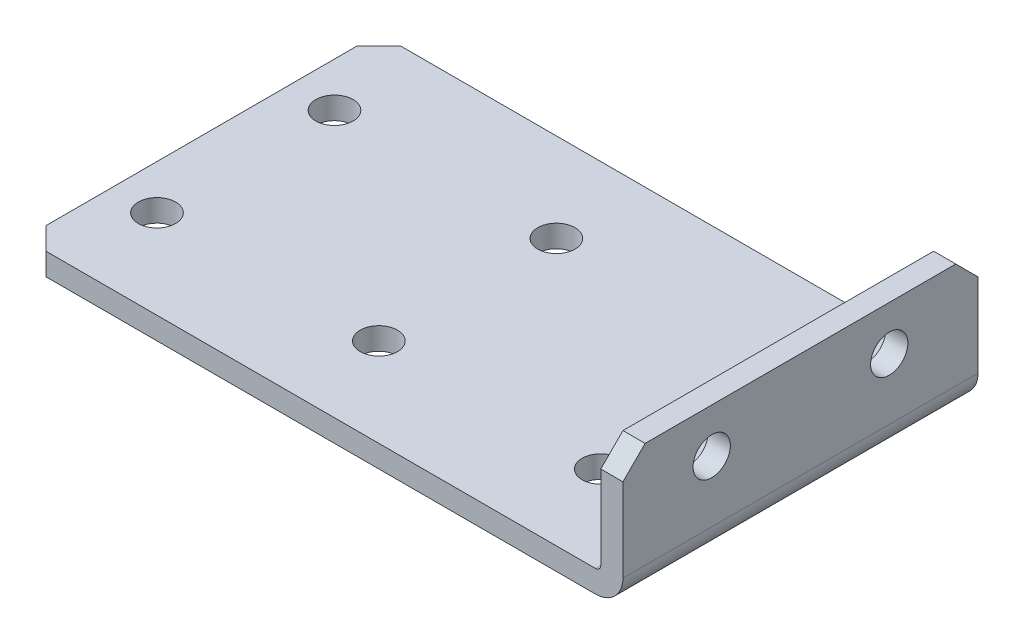
ISO-10303-21;
HEADER;
FILE_DESCRIPTION(('STEP AP214'),'2;1');
FILE_NAME('part.step','',(''),(''),'','','');
FILE_SCHEMA(('AUTOMOTIVE_DESIGN { 1 0 10303 214 1 1 1 1 }'));
ENDSEC;
DATA;
#1=APPLICATION_CONTEXT('core data for automotive mechanical design processes');
#2=APPLICATION_PROTOCOL_DEFINITION('international standard','automotive_design',2000,#1);
#3=PRODUCT_CONTEXT('',#1,'mechanical');
#4=PRODUCT('Part','Part','',(#3));
#5=PRODUCT_RELATED_PRODUCT_CATEGORY('part','',(#4));
#6=PRODUCT_DEFINITION_FORMATION('','',#4);
#7=PRODUCT_DEFINITION_CONTEXT('part definition',#1,'design');
#8=PRODUCT_DEFINITION('design','',#6,#7);
#9=PRODUCT_DEFINITION_SHAPE('','',#8);
#10=(LENGTH_UNIT() NAMED_UNIT(*) SI_UNIT(.MILLI.,.METRE.));
#11=(NAMED_UNIT(*) PLANE_ANGLE_UNIT() SI_UNIT($,.RADIAN.));
#12=(NAMED_UNIT(*) SI_UNIT($,.STERADIAN.) SOLID_ANGLE_UNIT());
#13=UNCERTAINTY_MEASURE_WITH_UNIT(LENGTH_MEASURE(1.E-05),#10,'distance_accuracy_value','');
#14=(GEOMETRIC_REPRESENTATION_CONTEXT(3) GLOBAL_UNCERTAINTY_ASSIGNED_CONTEXT((#13)) GLOBAL_UNIT_ASSIGNED_CONTEXT((#10,
#11,#12)) REPRESENTATION_CONTEXT('',''));
#15=CARTESIAN_POINT('',(0.,0.,0.));
#16=DIRECTION('',(0.,0.,1.));
#17=DIRECTION('',(1.,0.,0.));
#18=AXIS2_PLACEMENT_3D('',#15,#16,#17);
#19=CARTESIAN_POINT('',(85.7250000000001,12.7000000000001,-25.4));
#20=DIRECTION('',(-1.,0.,0.));
#21=DIRECTION('',(0.,-1.,0.));
#22=AXIS2_PLACEMENT_3D('',#19,#20,#21);
#23=CYLINDRICAL_SURFACE('',#22,2.667);
#24=CARTESIAN_POINT('',(85.7250000000001,12.7000000000001,-25.4));
#25=DIRECTION('',(-1.,0.,0.));
#26=DIRECTION('',(0.,-1.,0.));
#27=AXIS2_PLACEMENT_3D('',#24,#25,#26);
#28=CIRCLE('',#27,2.667);
#29=CARTESIAN_POINT('',(85.7250000000001,10.0330000000001,-25.4));
#30=VERTEX_POINT('',#29);
#31=EDGE_CURVE('E224',#30,#30,#28,.F.);
#32=ORIENTED_EDGE('',*,*,#31,.T.);
#33=EDGE_LOOP('',(#32));
#34=FACE_BOUND('',#33,.T.);
#35=CARTESIAN_POINT('',(82.55,12.7000000000001,-25.4));
#36=DIRECTION('',(-1.,0.,0.));
#37=DIRECTION('',(0.,-1.,0.));
#38=AXIS2_PLACEMENT_3D('',#35,#36,#37);
#39=CIRCLE('',#38,2.667);
#40=CARTESIAN_POINT('',(82.55,10.0330000000001,-25.4));
#41=VERTEX_POINT('',#40);
#42=EDGE_CURVE('E228',#41,#41,#39,.F.);
#43=ORIENTED_EDGE('',*,*,#42,.F.);
#44=EDGE_LOOP('',(#43));
#45=FACE_BOUND('',#44,.T.);
#46=ADVANCED_FACE('F16',(#34,#45),#23,.F.);
#47=CARTESIAN_POINT('',(85.7250000000001,12.7000000000001,-50.8));
#48=DIRECTION('',(-1.,0.,0.));
#49=DIRECTION('',(0.,-1.,0.));
#50=AXIS2_PLACEMENT_3D('',#47,#48,#49);
#51=CYLINDRICAL_SURFACE('',#50,2.667);
#52=CARTESIAN_POINT('',(85.7250000000001,12.7000000000001,-50.8));
#53=DIRECTION('',(-1.,0.,0.));
#54=DIRECTION('',(0.,-1.,0.));
#55=AXIS2_PLACEMENT_3D('',#52,#53,#54);
#56=CIRCLE('',#55,2.667);
#57=CARTESIAN_POINT('',(85.7250000000001,10.0330000000001,-50.8));
#58=VERTEX_POINT('',#57);
#59=EDGE_CURVE('E217',#58,#58,#56,.F.);
#60=ORIENTED_EDGE('',*,*,#59,.T.);
#61=EDGE_LOOP('',(#60));
#62=FACE_BOUND('',#61,.T.);
#63=CARTESIAN_POINT('',(82.55,12.7000000000001,-50.8));
#64=DIRECTION('',(-1.,0.,0.));
#65=DIRECTION('',(0.,-1.,0.));
#66=AXIS2_PLACEMENT_3D('',#63,#64,#65);
#67=CIRCLE('',#66,2.667);
#68=CARTESIAN_POINT('',(82.55,10.0330000000001,-50.8));
#69=VERTEX_POINT('',#68);
#70=EDGE_CURVE('E251',#69,#69,#67,.F.);
#71=ORIENTED_EDGE('',*,*,#70,.F.);
#72=EDGE_LOOP('',(#71));
#73=FACE_BOUND('',#72,.T.);
#74=ADVANCED_FACE('F424',(#62,#73),#51,.F.);
#75=CARTESIAN_POINT('',(85.7250000000001,19.05,0.));
#76=DIRECTION('',(0.,-1.,0.));
#77=DIRECTION('',(1.,0.,0.));
#78=AXIS2_PLACEMENT_3D('',#75,#76,#77);
#79=PLANE('',#78);
#80=DIRECTION('',(1.,0.,0.));
#81=VECTOR('',#80,1.);
#82=CARTESIAN_POINT('',(85.7250000000001,19.05,-60.325));
#83=LINE('',#82,#81);
#84=CARTESIAN_POINT('',(85.7250000000001,19.05,-60.325));
#85=VERTEX_POINT('',#84);
#86=CARTESIAN_POINT('',(82.5500000000001,19.05,-60.325));
#87=VERTEX_POINT('',#86);
#88=EDGE_CURVE('E242',#85,#87,#83,.F.);
#89=ORIENTED_EDGE('',*,*,#88,.T.);
#90=DIRECTION('',(0.,0.,1.));
#91=VECTOR('',#90,1.);
#92=CARTESIAN_POINT('',(82.5500000000001,19.05,0.));
#93=LINE('',#92,#91);
#94=CARTESIAN_POINT('',(82.55,19.05,-15.875));
#95=VERTEX_POINT('',#94);
#96=EDGE_CURVE('E252',#95,#87,#93,.F.);
#97=ORIENTED_EDGE('',*,*,#96,.F.);
#98=DIRECTION('',(1.,0.,0.));
#99=VECTOR('',#98,1.);
#100=CARTESIAN_POINT('',(85.7250000000001,19.05,-15.875));
#101=LINE('',#100,#99);
#102=CARTESIAN_POINT('',(85.7250000000001,19.05,-15.875));
#103=VERTEX_POINT('',#102);
#104=EDGE_CURVE('E225',#95,#103,#101,.T.);
#105=ORIENTED_EDGE('',*,*,#104,.T.);
#106=DIRECTION('',(0.,0.,1.));
#107=VECTOR('',#106,1.);
#108=CARTESIAN_POINT('',(85.7250000000001,19.05,0.));
#109=LINE('',#108,#107);
#110=EDGE_CURVE('E216',#103,#85,#109,.F.);
#111=ORIENTED_EDGE('',*,*,#110,.T.);
#112=EDGE_LOOP('',(#89,#97,#105,#111));
#113=FACE_BOUND('',#112,.T.);
#114=ADVANCED_FACE('F345',(#113),#79,.F.);
#115=CARTESIAN_POINT('',(85.7250000000001,19.05,-60.325));
#116=DIRECTION('',(0.,-0.707106781186548,0.707106781186548));
#117=DIRECTION('',(0.,-0.707106781186548,-0.707106781186548));
#118=AXIS2_PLACEMENT_3D('',#115,#116,#117);
#119=PLANE('',#118);
#120=DIRECTION('',(1.,0.,0.));
#121=VECTOR('',#120,1.);
#122=CARTESIAN_POINT('',(85.7250000000001,15.875,-63.5));
#123=LINE('',#122,#121);
#124=CARTESIAN_POINT('',(85.725,15.875,-63.5));
#125=VERTEX_POINT('',#124);
#126=CARTESIAN_POINT('',(82.55,15.875,-63.5));
#127=VERTEX_POINT('',#126);
#128=EDGE_CURVE('E138',#125,#127,#123,.F.);
#129=ORIENTED_EDGE('',*,*,#128,.T.);
#130=DIRECTION('',(0.,-0.707106781186545,-0.70710678118655));
#131=VECTOR('',#130,1.);
#132=CARTESIAN_POINT('',(82.5500000000001,19.05,-60.325));
#133=LINE('',#132,#131);
#134=EDGE_CURVE('E256',#87,#127,#133,.T.);
#135=ORIENTED_EDGE('',*,*,#134,.F.);
#136=ORIENTED_EDGE('',*,*,#88,.F.);
#137=DIRECTION('',(0.,-0.707106781186546,-0.707106781186549));
#138=VECTOR('',#137,1.);
#139=CARTESIAN_POINT('',(85.7250000000001,19.05,-60.325));
#140=LINE('',#139,#138);
#141=EDGE_CURVE('E235',#85,#125,#140,.T.);
#142=ORIENTED_EDGE('',*,*,#141,.T.);
#143=EDGE_LOOP('',(#129,#135,#136,#142));
#144=FACE_BOUND('',#143,.T.);
#145=ADVANCED_FACE('F342',(#144),#119,.F.);
#146=CARTESIAN_POINT('',(81.788,3.937,-63.5));
#147=DIRECTION('',(0.,0.,-1.));
#148=DIRECTION('',(-1.,0.,0.));
#149=AXIS2_PLACEMENT_3D('',#146,#147,#148);
#150=CYLINDRICAL_SURFACE('',#149,0.761999999999999);
#151=CARTESIAN_POINT('',(81.788,3.937,-12.7));
#152=DIRECTION('',(0.,0.,-1.));
#153=DIRECTION('',(-1.,0.,0.));
#154=AXIS2_PLACEMENT_3D('',#151,#152,#153);
#155=CIRCLE('',#154,0.761999999999999);
#156=CARTESIAN_POINT('',(82.55,3.937,-12.7));
#157=VERTEX_POINT('',#156);
#158=CARTESIAN_POINT('',(81.788,3.175,-12.7));
#159=VERTEX_POINT('',#158);
#160=EDGE_CURVE('E19',#157,#159,#155,.T.);
#161=ORIENTED_EDGE('',*,*,#160,.F.);
#162=DIRECTION('',(0.,0.,1.));
#163=VECTOR('',#162,1.);
#164=CARTESIAN_POINT('',(82.55,3.937,0.));
#165=LINE('',#164,#163);
#166=CARTESIAN_POINT('',(82.55,3.93699999999999,-63.5));
#167=VERTEX_POINT('',#166);
#168=EDGE_CURVE('E226',#167,#157,#165,.T.);
#169=ORIENTED_EDGE('',*,*,#168,.F.);
#170=CARTESIAN_POINT('',(81.788,3.937,-63.5));
#171=DIRECTION('',(0.,0.,-1.));
#172=DIRECTION('',(-1.,0.,0.));
#173=AXIS2_PLACEMENT_3D('',#170,#171,#172);
#174=CIRCLE('',#173,0.761999999999999);
#175=CARTESIAN_POINT('',(81.788,3.175,-63.5));
#176=VERTEX_POINT('',#175);
#177=EDGE_CURVE('E137',#167,#176,#174,.T.);
#178=ORIENTED_EDGE('',*,*,#177,.T.);
#179=DIRECTION('',(0.,0.,-1.));
#180=VECTOR('',#179,1.);
#181=CARTESIAN_POINT('',(81.788,3.175,-63.5));
#182=LINE('',#181,#180);
#183=EDGE_CURVE('E140',#176,#159,#182,.F.);
#184=ORIENTED_EDGE('',*,*,#183,.T.);
#185=EDGE_LOOP('',(#161,#169,#178,#184));
#186=FACE_BOUND('',#185,.T.);
#187=ADVANCED_FACE('F141',(#186),#150,.F.);
#188=CARTESIAN_POINT('',(82.5500000000001,19.05,0.));
#189=DIRECTION('',(-1.,0.,0.));
#190=DIRECTION('',(0.,-1.,0.));
#191=AXIS2_PLACEMENT_3D('',#188,#189,#190);
#192=PLANE('',#191);
#193=ORIENTED_EDGE('',*,*,#70,.T.);
#194=EDGE_LOOP('',(#193));
#195=FACE_BOUND('',#194,.T.);
#196=ORIENTED_EDGE('',*,*,#42,.T.);
#197=EDGE_LOOP('',(#196));
#198=FACE_BOUND('',#197,.T.);
#199=DIRECTION('',(0.,1.,0.));
#200=VECTOR('',#199,1.);
#201=CARTESIAN_POINT('',(82.55,0.,-12.7));
#202=LINE('',#201,#200);
#203=CARTESIAN_POINT('',(82.55,15.875,-12.7));
#204=VERTEX_POINT('',#203);
#205=EDGE_CURVE('E135',#157,#204,#202,.T.);
#206=ORIENTED_EDGE('',*,*,#205,.T.);
#207=DIRECTION('',(0.,0.707106781186549,-0.707106781186546));
#208=VECTOR('',#207,1.);
#209=CARTESIAN_POINT('',(82.55,19.05,-15.875));
#210=LINE('',#209,#208);
#211=EDGE_CURVE('E220',#204,#95,#210,.T.);
#212=ORIENTED_EDGE('',*,*,#211,.T.);
#213=ORIENTED_EDGE('',*,*,#96,.T.);
#214=ORIENTED_EDGE('',*,*,#134,.T.);
#215=DIRECTION('',(0.,-1.,0.));
#216=VECTOR('',#215,1.);
#217=CARTESIAN_POINT('',(82.5500000000001,19.05,-63.5));
#218=LINE('',#217,#216);
#219=EDGE_CURVE('E229',#127,#167,#218,.T.);
#220=ORIENTED_EDGE('',*,*,#219,.T.);
#221=ORIENTED_EDGE('',*,*,#168,.T.);
#222=EDGE_LOOP('',(#206,#212,#213,#214,#220,#221));
#223=FACE_BOUND('',#222,.T.);
#224=ADVANCED_FACE('F351',(#195,#198,#223),#192,.T.);
#225=CARTESIAN_POINT('',(85.7250000000001,19.05,-15.875));
#226=DIRECTION('',(0.,-0.707106781186546,-0.707106781186549));
#227=DIRECTION('',(0.,0.707106781186549,-0.707106781186546));
#228=AXIS2_PLACEMENT_3D('',#225,#226,#227);
#229=PLANE('',#228);
#230=DIRECTION('',(-1.,0.,0.));
#231=VECTOR('',#230,1.);
#232=CARTESIAN_POINT('',(-9.42940188980387,15.875,-12.7));
#233=LINE('',#232,#231);
#234=CARTESIAN_POINT('',(85.725,15.875,-12.7));
#235=VERTEX_POINT('',#234);
#236=EDGE_CURVE('E160',#204,#235,#233,.F.);
#237=ORIENTED_EDGE('',*,*,#236,.T.);
#238=DIRECTION('',(0.,0.707106781186549,-0.707106781186546));
#239=VECTOR('',#238,1.);
#240=CARTESIAN_POINT('',(85.725,15.875,-12.7));
#241=LINE('',#240,#239);
#242=EDGE_CURVE('E213',#235,#103,#241,.T.);
#243=ORIENTED_EDGE('',*,*,#242,.T.);
#244=ORIENTED_EDGE('',*,*,#104,.F.);
#245=ORIENTED_EDGE('',*,*,#211,.F.);
#246=EDGE_LOOP('',(#237,#243,#244,#245));
#247=FACE_BOUND('',#246,.T.);
#248=ADVANCED_FACE('F349',(#247),#229,.F.);
#249=CARTESIAN_POINT('',(85.7250000000001,19.05,0.));
#250=DIRECTION('',(-1.,0.,0.));
#251=DIRECTION('',(0.,-1.,0.));
#252=AXIS2_PLACEMENT_3D('',#249,#250,#251);
#253=PLANE('',#252);
#254=ORIENTED_EDGE('',*,*,#141,.F.);
#255=ORIENTED_EDGE('',*,*,#110,.F.);
#256=ORIENTED_EDGE('',*,*,#242,.F.);
#257=DIRECTION('',(0.,1.,0.));
#258=VECTOR('',#257,1.);
#259=CARTESIAN_POINT('',(85.725,0.,-12.7));
#260=LINE('',#259,#258);
#261=CARTESIAN_POINT('',(85.725,3.93699999999999,-12.7));
#262=VERTEX_POINT('',#261);
#263=EDGE_CURVE('E183',#235,#262,#260,.F.);
#264=ORIENTED_EDGE('',*,*,#263,.T.);
#265=DIRECTION('',(0.,0.,-1.));
#266=VECTOR('',#265,1.);
#267=CARTESIAN_POINT('',(85.725,3.93699999999999,-63.5));
#268=LINE('',#267,#266);
#269=CARTESIAN_POINT('',(85.725,3.93699999999999,-63.5));
#270=VERTEX_POINT('',#269);
#271=EDGE_CURVE('E163',#270,#262,#268,.F.);
#272=ORIENTED_EDGE('',*,*,#271,.F.);
#273=DIRECTION('',(0.,-1.,0.));
#274=VECTOR('',#273,1.);
#275=CARTESIAN_POINT('',(85.7250000000001,19.05,-63.5));
#276=LINE('',#275,#274);
#277=EDGE_CURVE('E147',#125,#270,#276,.T.);
#278=ORIENTED_EDGE('',*,*,#277,.F.);
#279=EDGE_LOOP('',(#254,#255,#256,#264,#272,#278));
#280=FACE_BOUND('',#279,.T.);
#281=ORIENTED_EDGE('',*,*,#59,.F.);
#282=EDGE_LOOP('',(#281));
#283=FACE_BOUND('',#282,.T.);
#284=ORIENTED_EDGE('',*,*,#31,.F.);
#285=EDGE_LOOP('',(#284));
#286=FACE_BOUND('',#285,.T.);
#287=ADVANCED_FACE('F327',(#280,#283,#286),#253,.F.);
#288=CARTESIAN_POINT('',(0.,3.175,-63.5));
#289=DIRECTION('',(0.,-1.,0.));
#290=DIRECTION('',(0.,0.,-1.));
#291=AXIS2_PLACEMENT_3D('',#288,#289,#290);
#292=PLANE('',#291);
#293=DIRECTION('',(0.707106781186548,0.,-0.707106781186548));
#294=VECTOR('',#293,1.);
#295=CARTESIAN_POINT('',(3.17500000000001,3.175,-63.5));
#296=LINE('',#295,#294);
#297=CARTESIAN_POINT('',(3.17500000000001,3.175,-63.5));
#298=VERTEX_POINT('',#297);
#299=CARTESIAN_POINT('',(0.,3.175,-60.325));
#300=VERTEX_POINT('',#299);
#301=EDGE_CURVE('E200',#298,#300,#296,.F.);
#302=ORIENTED_EDGE('',*,*,#301,.T.);
#303=DIRECTION('',(0.,0.,-1.));
#304=VECTOR('',#303,1.);
#305=CARTESIAN_POINT('',(0.,3.175,0.));
#306=LINE('',#305,#304);
#307=CARTESIAN_POINT('',(0.,3.175,-15.875));
#308=VERTEX_POINT('',#307);
#309=EDGE_CURVE('E146',#300,#308,#306,.F.);
#310=ORIENTED_EDGE('',*,*,#309,.T.);
#311=DIRECTION('',(-0.707106781186548,0.,-0.707106781186547));
#312=VECTOR('',#311,1.);
#313=CARTESIAN_POINT('',(3.17500000000001,3.175,-12.7));
#314=LINE('',#313,#312);
#315=CARTESIAN_POINT('',(3.17500000000001,3.175,-12.7));
#316=VERTEX_POINT('',#315);
#317=EDGE_CURVE('E152',#308,#316,#314,.F.);
#318=ORIENTED_EDGE('',*,*,#317,.T.);
#319=DIRECTION('',(-1.,0.,0.));
#320=VECTOR('',#319,1.);
#321=CARTESIAN_POINT('',(-9.42940188980387,3.175,-12.7));
#322=LINE('',#321,#320);
#323=EDGE_CURVE('E133',#316,#159,#322,.F.);
#324=ORIENTED_EDGE('',*,*,#323,.T.);
#325=ORIENTED_EDGE('',*,*,#183,.F.);
#326=DIRECTION('',(1.,0.,0.));
#327=VECTOR('',#326,1.);
#328=CARTESIAN_POINT('',(0.,3.175,-63.5));
#329=LINE('',#328,#327);
#330=EDGE_CURVE('E192',#176,#298,#329,.F.);
#331=ORIENTED_EDGE('',*,*,#330,.T.);
#332=EDGE_LOOP('',(#302,#310,#318,#324,#325,#331));
#333=FACE_BOUND('',#332,.T.);
#334=CARTESIAN_POINT('',(6.34999999999999,3.175,-50.8));
#335=DIRECTION('',(0.,1.,0.));
#336=DIRECTION('',(0.,0.,1.));
#337=AXIS2_PLACEMENT_3D('',#334,#335,#336);
#338=CIRCLE('',#337,2.667);
#339=CARTESIAN_POINT('',(6.34999999999999,3.175,-48.133));
#340=VERTEX_POINT('',#339);
#341=EDGE_CURVE('E204',#340,#340,#338,.F.);
#342=ORIENTED_EDGE('',*,*,#341,.T.);
#343=EDGE_LOOP('',(#342));
#344=FACE_BOUND('',#343,.T.);
#345=CARTESIAN_POINT('',(6.35,3.175,-25.4));
#346=DIRECTION('',(0.,1.,0.));
#347=DIRECTION('',(0.,0.,1.));
#348=AXIS2_PLACEMENT_3D('',#345,#346,#347);
#349=CIRCLE('',#348,2.667);
#350=CARTESIAN_POINT('',(6.35,3.175,-22.733));
#351=VERTEX_POINT('',#350);
#352=EDGE_CURVE('E283',#351,#351,#349,.F.);
#353=ORIENTED_EDGE('',*,*,#352,.T.);
#354=EDGE_LOOP('',(#353));
#355=FACE_BOUND('',#354,.T.);
#356=CARTESIAN_POINT('',(69.85,3.175,-50.8));
#357=DIRECTION('',(0.,1.,0.));
#358=DIRECTION('',(0.,0.,1.));
#359=AXIS2_PLACEMENT_3D('',#356,#357,#358);
#360=CIRCLE('',#359,2.667);
#361=CARTESIAN_POINT('',(69.85,3.175,-48.133));
#362=VERTEX_POINT('',#361);
#363=EDGE_CURVE('E287',#362,#362,#360,.F.);
#364=ORIENTED_EDGE('',*,*,#363,.T.);
#365=EDGE_LOOP('',(#364));
#366=FACE_BOUND('',#365,.T.);
#367=CARTESIAN_POINT('',(69.85,3.175,-25.4));
#368=DIRECTION('',(0.,1.,0.));
#369=DIRECTION('',(0.,0.,1.));
#370=AXIS2_PLACEMENT_3D('',#367,#368,#369);
#371=CIRCLE('',#370,2.667);
#372=CARTESIAN_POINT('',(69.85,3.175,-22.733));
#373=VERTEX_POINT('',#372);
#374=EDGE_CURVE('E291',#373,#373,#371,.F.);
#375=ORIENTED_EDGE('',*,*,#374,.T.);
#376=EDGE_LOOP('',(#375));
#377=FACE_BOUND('',#376,.T.);
#378=CARTESIAN_POINT('',(38.1,3.175,-50.8));
#379=DIRECTION('',(0.,1.,0.));
#380=DIRECTION('',(0.,0.,1.));
#381=AXIS2_PLACEMENT_3D('',#378,#379,#380);
#382=CIRCLE('',#381,2.667);
#383=CARTESIAN_POINT('',(38.1,3.175,-48.133));
#384=VERTEX_POINT('',#383);
#385=EDGE_CURVE('E295',#384,#384,#382,.F.);
#386=ORIENTED_EDGE('',*,*,#385,.T.);
#387=EDGE_LOOP('',(#386));
#388=FACE_BOUND('',#387,.T.);
#389=CARTESIAN_POINT('',(38.1,3.175,-25.4));
#390=DIRECTION('',(0.,1.,0.));
#391=DIRECTION('',(0.,0.,1.));
#392=AXIS2_PLACEMENT_3D('',#389,#390,#391);
#393=CIRCLE('',#392,2.667);
#394=CARTESIAN_POINT('',(38.1,3.175,-22.733));
#395=VERTEX_POINT('',#394);
#396=EDGE_CURVE('E212',#395,#395,#393,.F.);
#397=ORIENTED_EDGE('',*,*,#396,.T.);
#398=EDGE_LOOP('',(#397));
#399=FACE_BOUND('',#398,.T.);
#400=ADVANCED_FACE('F149',(#333,#344,#355,#366,#377,#388,#399),#292,.F.);
#401=CARTESIAN_POINT('',(0.,3.175,0.));
#402=DIRECTION('',(1.,0.,0.));
#403=DIRECTION('',(0.,0.,-1.));
#404=AXIS2_PLACEMENT_3D('',#401,#402,#403);
#405=PLANE('',#404);
#406=DIRECTION('',(0.,1.,0.));
#407=VECTOR('',#406,1.);
#408=CARTESIAN_POINT('',(0.,3.175,-60.325));
#409=LINE('',#408,#407);
#410=CARTESIAN_POINT('',(0.,0.,-60.325));
#411=VERTEX_POINT('',#410);
#412=EDGE_CURVE('E197',#300,#411,#409,.F.);
#413=ORIENTED_EDGE('',*,*,#412,.T.);
#414=DIRECTION('',(0.,0.,-1.));
#415=VECTOR('',#414,1.);
#416=CARTESIAN_POINT('',(0.,0.,-63.5));
#417=LINE('',#416,#415);
#418=CARTESIAN_POINT('',(0.,0.,-15.875));
#419=VERTEX_POINT('',#418);
#420=EDGE_CURVE('E196',#419,#411,#417,.T.);
#421=ORIENTED_EDGE('',*,*,#420,.F.);
#422=DIRECTION('',(0.,1.,0.));
#423=VECTOR('',#422,1.);
#424=CARTESIAN_POINT('',(0.,0.,-15.875));
#425=LINE('',#424,#423);
#426=EDGE_CURVE('E182',#419,#308,#425,.T.);
#427=ORIENTED_EDGE('',*,*,#426,.T.);
#428=ORIENTED_EDGE('',*,*,#309,.F.);
#429=EDGE_LOOP('',(#413,#421,#427,#428));
#430=FACE_BOUND('',#429,.T.);
#431=ADVANCED_FACE('F360',(#430),#405,.F.);
#432=CARTESIAN_POINT('',(3.17500000000001,3.175,-63.5));
#433=DIRECTION('',(0.707106781186548,0.,0.707106781186548));
#434=DIRECTION('',(0.707106781186548,0.,-0.707106781186548));
#435=AXIS2_PLACEMENT_3D('',#432,#433,#434);
#436=PLANE('',#435);
#437=ORIENTED_EDGE('',*,*,#412,.F.);
#438=ORIENTED_EDGE('',*,*,#301,.F.);
#439=DIRECTION('',(0.,1.,0.));
#440=VECTOR('',#439,1.);
#441=CARTESIAN_POINT('',(3.17500000000001,3.175,-63.5));
#442=LINE('',#441,#440);
#443=CARTESIAN_POINT('',(3.17500000000001,0.,-63.5));
#444=VERTEX_POINT('',#443);
#445=EDGE_CURVE('E188',#298,#444,#442,.F.);
#446=ORIENTED_EDGE('',*,*,#445,.T.);
#447=DIRECTION('',(0.707106781186547,0.,-0.707106781186548));
#448=VECTOR('',#447,1.);
#449=CARTESIAN_POINT('',(0.,0.,-60.325));
#450=LINE('',#449,#448);
#451=EDGE_CURVE('E187',#411,#444,#450,.T.);
#452=ORIENTED_EDGE('',*,*,#451,.F.);
#453=EDGE_LOOP('',(#437,#438,#446,#452));
#454=FACE_BOUND('',#453,.T.);
#455=ADVANCED_FACE('F356',(#454),#436,.F.);
#456=CARTESIAN_POINT('',(0.,3.175,-63.5));
#457=DIRECTION('',(0.,0.,1.));
#458=DIRECTION('',(1.,0.,0.));
#459=AXIS2_PLACEMENT_3D('',#456,#457,#458);
#460=PLANE('',#459);
#461=ORIENTED_EDGE('',*,*,#445,.F.);
#462=ORIENTED_EDGE('',*,*,#330,.F.);
#463=ORIENTED_EDGE('',*,*,#177,.F.);
#464=ORIENTED_EDGE('',*,*,#219,.F.);
#465=ORIENTED_EDGE('',*,*,#128,.F.);
#466=ORIENTED_EDGE('',*,*,#277,.T.);
#467=CARTESIAN_POINT('',(81.788,3.937,-63.5));
#468=DIRECTION('',(0.,0.,-1.));
#469=DIRECTION('',(-1.,0.,0.));
#470=AXIS2_PLACEMENT_3D('',#467,#468,#469);
#471=CIRCLE('',#470,3.937);
#472=CARTESIAN_POINT('',(81.788,0.,-63.5));
#473=VERTEX_POINT('',#472);
#474=EDGE_CURVE('E191',#473,#270,#471,.F.);
#475=ORIENTED_EDGE('',*,*,#474,.F.);
#476=DIRECTION('',(1.,0.,0.));
#477=VECTOR('',#476,1.);
#478=CARTESIAN_POINT('',(0.,0.,-63.5));
#479=LINE('',#478,#477);
#480=EDGE_CURVE('E172',#444,#473,#479,.T.);
#481=ORIENTED_EDGE('',*,*,#480,.F.);
#482=EDGE_LOOP('',(#461,#462,#463,#464,#465,#466,#475,#481));
#483=FACE_BOUND('',#482,.T.);
#484=ADVANCED_FACE('F337',(#483),#460,.F.);
#485=CARTESIAN_POINT('',(81.788,3.937,-63.5));
#486=DIRECTION('',(0.,0.,-1.));
#487=DIRECTION('',(-1.,0.,0.));
#488=AXIS2_PLACEMENT_3D('',#485,#486,#487);
#489=CYLINDRICAL_SURFACE('',#488,3.937);
#490=ORIENTED_EDGE('',*,*,#474,.T.);
#491=ORIENTED_EDGE('',*,*,#271,.T.);
#492=CARTESIAN_POINT('',(81.788,3.937,-12.7));
#493=DIRECTION('',(0.,0.,-1.));
#494=DIRECTION('',(-1.,0.,0.));
#495=AXIS2_PLACEMENT_3D('',#492,#493,#494);
#496=CIRCLE('',#495,3.937);
#497=CARTESIAN_POINT('',(81.788,0.,-12.7));
#498=VERTEX_POINT('',#497);
#499=EDGE_CURVE('E154',#262,#498,#496,.T.);
#500=ORIENTED_EDGE('',*,*,#499,.T.);
#501=DIRECTION('',(0.,0.,-1.));
#502=VECTOR('',#501,1.);
#503=CARTESIAN_POINT('',(81.788,0.,-63.5));
#504=LINE('',#503,#502);
#505=EDGE_CURVE('E167',#473,#498,#504,.F.);
#506=ORIENTED_EDGE('',*,*,#505,.F.);
#507=EDGE_LOOP('',(#490,#491,#500,#506));
#508=FACE_BOUND('',#507,.T.);
#509=ADVANCED_FACE('F333',(#508),#489,.T.);
#510=CARTESIAN_POINT('',(-9.42940188980387,0.,-12.7));
#511=DIRECTION('',(0.,0.,-1.));
#512=DIRECTION('',(-1.,0.,0.));
#513=AXIS2_PLACEMENT_3D('',#510,#511,#512);
#514=PLANE('',#513);
#515=ORIENTED_EDGE('',*,*,#236,.F.);
#516=ORIENTED_EDGE('',*,*,#205,.F.);
#517=ORIENTED_EDGE('',*,*,#160,.T.);
#518=ORIENTED_EDGE('',*,*,#323,.F.);
#519=DIRECTION('',(0.,1.,0.));
#520=VECTOR('',#519,1.);
#521=CARTESIAN_POINT('',(3.17500000000001,0.,-12.7));
#522=LINE('',#521,#520);
#523=CARTESIAN_POINT('',(3.17500000000001,0.,-12.7));
#524=VERTEX_POINT('',#523);
#525=EDGE_CURVE('E39',#316,#524,#522,.F.);
#526=ORIENTED_EDGE('',*,*,#525,.T.);
#527=DIRECTION('',(1.,0.,0.));
#528=VECTOR('',#527,1.);
#529=CARTESIAN_POINT('',(0.,0.,-12.7));
#530=LINE('',#529,#528);
#531=EDGE_CURVE('E171',#498,#524,#530,.F.);
#532=ORIENTED_EDGE('',*,*,#531,.F.);
#533=ORIENTED_EDGE('',*,*,#499,.F.);
#534=ORIENTED_EDGE('',*,*,#263,.F.);
#535=EDGE_LOOP('',(#515,#516,#517,#518,#526,#532,#533,#534));
#536=FACE_BOUND('',#535,.T.);
#537=ADVANCED_FACE('F131',(#536),#514,.F.);
#538=CARTESIAN_POINT('',(3.17500000000001,0.,-12.7));
#539=DIRECTION('',(0.707106781186547,0.,-0.707106781186548));
#540=DIRECTION('',(-0.707106781186548,0.,-0.707106781186547));
#541=AXIS2_PLACEMENT_3D('',#538,#539,#540);
#542=PLANE('',#541);
#543=ORIENTED_EDGE('',*,*,#426,.F.);
#544=DIRECTION('',(-0.707106781186547,0.,-0.707106781186548));
#545=VECTOR('',#544,1.);
#546=CARTESIAN_POINT('',(3.17500000000001,0.,-12.7));
#547=LINE('',#546,#545);
#548=EDGE_CURVE('E176',#524,#419,#547,.T.);
#549=ORIENTED_EDGE('',*,*,#548,.F.);
#550=ORIENTED_EDGE('',*,*,#525,.F.);
#551=ORIENTED_EDGE('',*,*,#317,.F.);
#552=EDGE_LOOP('',(#543,#549,#550,#551));
#553=FACE_BOUND('',#552,.T.);
#554=ADVANCED_FACE('F363',(#553),#542,.F.);
#555=CARTESIAN_POINT('',(38.1,0.,-25.4));
#556=DIRECTION('',(0.,1.,0.));
#557=DIRECTION('',(0.,0.,1.));
#558=AXIS2_PLACEMENT_3D('',#555,#556,#557);
#559=CYLINDRICAL_SURFACE('',#558,2.667);
#560=ORIENTED_EDGE('',*,*,#396,.F.);
#561=EDGE_LOOP('',(#560));
#562=FACE_BOUND('',#561,.T.);
#563=CARTESIAN_POINT('',(38.1,0.,-25.4));
#564=DIRECTION('',(0.,1.,0.));
#565=DIRECTION('',(0.,0.,1.));
#566=AXIS2_PLACEMENT_3D('',#563,#564,#565);
#567=CIRCLE('',#566,2.667);
#568=CARTESIAN_POINT('',(38.1,0.,-22.733));
#569=VERTEX_POINT('',#568);
#570=EDGE_CURVE('E180',#569,#569,#567,.T.);
#571=ORIENTED_EDGE('',*,*,#570,.F.);
#572=EDGE_LOOP('',(#571));
#573=FACE_BOUND('',#572,.T.);
#574=ADVANCED_FACE('F393',(#562,#573),#559,.F.);
#575=CARTESIAN_POINT('',(38.1,0.,-50.8));
#576=DIRECTION('',(0.,1.,0.));
#577=DIRECTION('',(0.,0.,1.));
#578=AXIS2_PLACEMENT_3D('',#575,#576,#577);
#579=CYLINDRICAL_SURFACE('',#578,2.667);
#580=ORIENTED_EDGE('',*,*,#385,.F.);
#581=EDGE_LOOP('',(#580));
#582=FACE_BOUND('',#581,.T.);
#583=CARTESIAN_POINT('',(38.1,0.,-50.8));
#584=DIRECTION('',(0.,1.,0.));
#585=DIRECTION('',(0.,0.,1.));
#586=AXIS2_PLACEMENT_3D('',#583,#584,#585);
#587=CIRCLE('',#586,2.667);
#588=CARTESIAN_POINT('',(38.1,0.,-48.133));
#589=VERTEX_POINT('',#588);
#590=EDGE_CURVE('E273',#589,#589,#587,.T.);
#591=ORIENTED_EDGE('',*,*,#590,.F.);
#592=EDGE_LOOP('',(#591));
#593=FACE_BOUND('',#592,.T.);
#594=ADVANCED_FACE('F389',(#582,#593),#579,.F.);
#595=CARTESIAN_POINT('',(69.85,0.,-25.4));
#596=DIRECTION('',(0.,1.,0.));
#597=DIRECTION('',(0.,0.,1.));
#598=AXIS2_PLACEMENT_3D('',#595,#596,#597);
#599=CYLINDRICAL_SURFACE('',#598,2.667);
#600=ORIENTED_EDGE('',*,*,#374,.F.);
#601=EDGE_LOOP('',(#600));
#602=FACE_BOUND('',#601,.T.);
#603=CARTESIAN_POINT('',(69.85,0.,-25.4));
#604=DIRECTION('',(0.,1.,0.));
#605=DIRECTION('',(0.,0.,1.));
#606=AXIS2_PLACEMENT_3D('',#603,#604,#605);
#607=CIRCLE('',#606,2.667);
#608=CARTESIAN_POINT('',(69.85,0.,-22.733));
#609=VERTEX_POINT('',#608);
#610=EDGE_CURVE('E269',#609,#609,#607,.T.);
#611=ORIENTED_EDGE('',*,*,#610,.F.);
#612=EDGE_LOOP('',(#611));
#613=FACE_BOUND('',#612,.T.);
#614=ADVANCED_FACE('F385',(#602,#613),#599,.F.);
#615=CARTESIAN_POINT('',(69.85,0.,-50.8));
#616=DIRECTION('',(0.,1.,0.));
#617=DIRECTION('',(0.,0.,1.));
#618=AXIS2_PLACEMENT_3D('',#615,#616,#617);
#619=CYLINDRICAL_SURFACE('',#618,2.667);
#620=ORIENTED_EDGE('',*,*,#363,.F.);
#621=EDGE_LOOP('',(#620));
#622=FACE_BOUND('',#621,.T.);
#623=CARTESIAN_POINT('',(69.85,0.,-50.8));
#624=DIRECTION('',(0.,1.,0.));
#625=DIRECTION('',(0.,0.,1.));
#626=AXIS2_PLACEMENT_3D('',#623,#624,#625);
#627=CIRCLE('',#626,2.667);
#628=CARTESIAN_POINT('',(69.85,0.,-48.133));
#629=VERTEX_POINT('',#628);
#630=EDGE_CURVE('E265',#629,#629,#627,.T.);
#631=ORIENTED_EDGE('',*,*,#630,.F.);
#632=EDGE_LOOP('',(#631));
#633=FACE_BOUND('',#632,.T.);
#634=ADVANCED_FACE('F381',(#622,#633),#619,.F.);
#635=CARTESIAN_POINT('',(6.35,0.,-25.4));
#636=DIRECTION('',(0.,1.,0.));
#637=DIRECTION('',(0.,0.,1.));
#638=AXIS2_PLACEMENT_3D('',#635,#636,#637);
#639=CYLINDRICAL_SURFACE('',#638,2.667);
#640=ORIENTED_EDGE('',*,*,#352,.F.);
#641=EDGE_LOOP('',(#640));
#642=FACE_BOUND('',#641,.T.);
#643=CARTESIAN_POINT('',(6.35,0.,-25.4));
#644=DIRECTION('',(0.,1.,0.));
#645=DIRECTION('',(0.,0.,1.));
#646=AXIS2_PLACEMENT_3D('',#643,#644,#645);
#647=CIRCLE('',#646,2.667);
#648=CARTESIAN_POINT('',(6.35,0.,-22.733));
#649=VERTEX_POINT('',#648);
#650=EDGE_CURVE('E26',#649,#649,#647,.T.);
#651=ORIENTED_EDGE('',*,*,#650,.F.);
#652=EDGE_LOOP('',(#651));
#653=FACE_BOUND('',#652,.T.);
#654=ADVANCED_FACE('F374',(#642,#653),#639,.F.);
#655=CARTESIAN_POINT('',(6.34999999999999,0.,-50.8));
#656=DIRECTION('',(0.,1.,0.));
#657=DIRECTION('',(0.,0.,1.));
#658=AXIS2_PLACEMENT_3D('',#655,#656,#657);
#659=CYLINDRICAL_SURFACE('',#658,2.667);
#660=ORIENTED_EDGE('',*,*,#341,.F.);
#661=EDGE_LOOP('',(#660));
#662=FACE_BOUND('',#661,.T.);
#663=CARTESIAN_POINT('',(6.34999999999999,0.,-50.8));
#664=DIRECTION('',(0.,1.,0.));
#665=DIRECTION('',(0.,0.,1.));
#666=AXIS2_PLACEMENT_3D('',#663,#664,#665);
#667=CIRCLE('',#666,2.667);
#668=CARTESIAN_POINT('',(6.34999999999999,0.,-48.133));
#669=VERTEX_POINT('',#668);
#670=EDGE_CURVE('E11',#669,#669,#667,.T.);
#671=ORIENTED_EDGE('',*,*,#670,.F.);
#672=EDGE_LOOP('',(#671));
#673=FACE_BOUND('',#672,.T.);
#674=ADVANCED_FACE('F367',(#662,#673),#659,.F.);
#675=CARTESIAN_POINT('',(0.,0.,-63.5));
#676=DIRECTION('',(0.,-1.,0.));
#677=DIRECTION('',(0.,0.,-1.));
#678=AXIS2_PLACEMENT_3D('',#675,#676,#677);
#679=PLANE('',#678);
#680=ORIENTED_EDGE('',*,*,#670,.T.);
#681=EDGE_LOOP('',(#680));
#682=FACE_BOUND('',#681,.T.);
#683=ORIENTED_EDGE('',*,*,#650,.T.);
#684=EDGE_LOOP('',(#683));
#685=FACE_BOUND('',#684,.T.);
#686=ORIENTED_EDGE('',*,*,#630,.T.);
#687=EDGE_LOOP('',(#686));
#688=FACE_BOUND('',#687,.T.);
#689=ORIENTED_EDGE('',*,*,#610,.T.);
#690=EDGE_LOOP('',(#689));
#691=FACE_BOUND('',#690,.T.);
#692=ORIENTED_EDGE('',*,*,#590,.T.);
#693=EDGE_LOOP('',(#692));
#694=FACE_BOUND('',#693,.T.);
#695=ORIENTED_EDGE('',*,*,#570,.T.);
#696=EDGE_LOOP('',(#695));
#697=FACE_BOUND('',#696,.T.);
#698=ORIENTED_EDGE('',*,*,#531,.T.);
#699=ORIENTED_EDGE('',*,*,#548,.T.);
#700=ORIENTED_EDGE('',*,*,#420,.T.);
#701=ORIENTED_EDGE('',*,*,#451,.T.);
#702=ORIENTED_EDGE('',*,*,#480,.T.);
#703=ORIENTED_EDGE('',*,*,#505,.T.);
#704=EDGE_LOOP('',(#698,#699,#700,#701,#702,#703));
#705=FACE_BOUND('',#704,.T.);
#706=ADVANCED_FACE('F365',(#682,#685,#688,#691,#694,#697,#705),#679,.T.);
#707=CLOSED_SHELL('',(#46,#74,#114,#145,#187,#224,#248,#287,#400,#431,#455,#484,#509,#537,#554,
#574,#594,#614,#634,#654,#674,#706));
#708=MANIFOLD_SOLID_BREP('B1',#707);
#709=ADVANCED_BREP_SHAPE_REPRESENTATION('',(#18,#708),#14);
#710=SHAPE_DEFINITION_REPRESENTATION(#9,#709);
ENDSEC;
END-ISO-10303-21;
